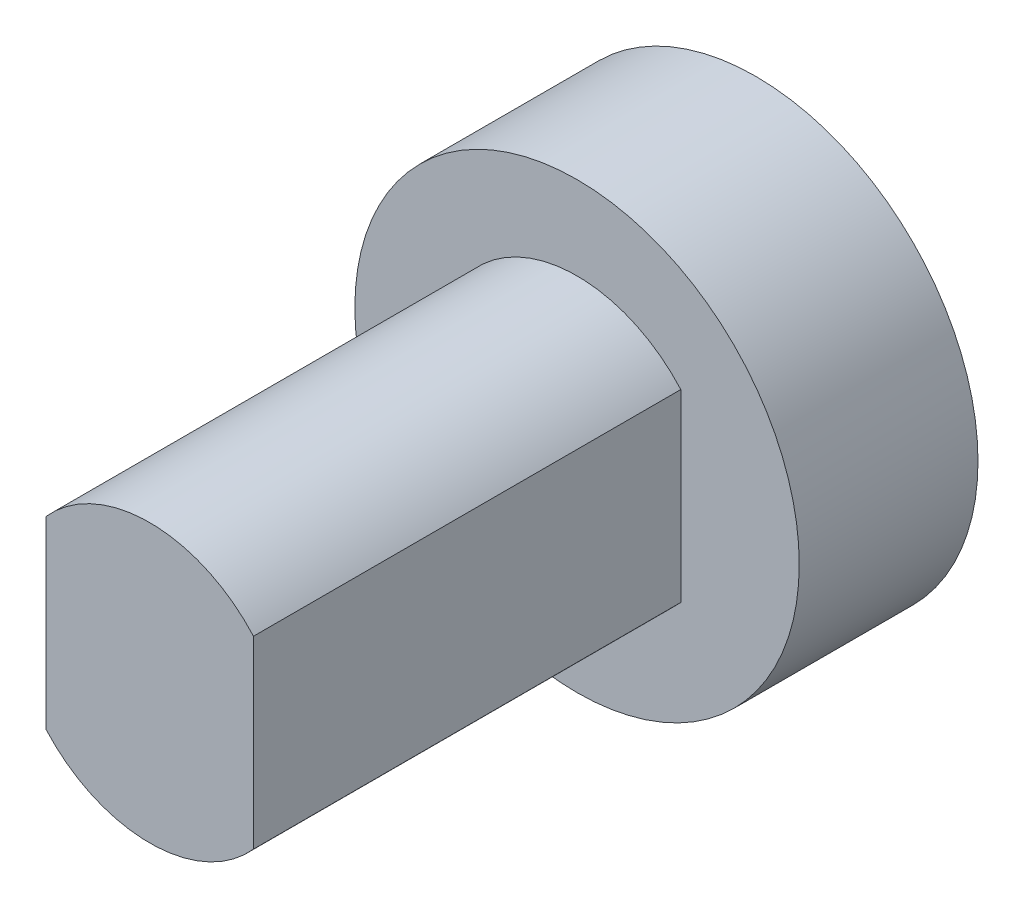
ISO-10303-21;
HEADER;
FILE_DESCRIPTION(('STEP AP214'),'2;1');
FILE_NAME('part.step','',(''),(''),'','','');
FILE_SCHEMA(('AUTOMOTIVE_DESIGN { 1 0 10303 214 1 1 1 1 }'));
ENDSEC;
DATA;
#1=APPLICATION_CONTEXT('core data for automotive mechanical design processes');
#2=APPLICATION_PROTOCOL_DEFINITION('international standard','automotive_design',2000,#1);
#3=PRODUCT_CONTEXT('',#1,'mechanical');
#4=PRODUCT('Part','Part','',(#3));
#5=PRODUCT_RELATED_PRODUCT_CATEGORY('part','',(#4));
#6=PRODUCT_DEFINITION_FORMATION('','',#4);
#7=PRODUCT_DEFINITION_CONTEXT('part definition',#1,'design');
#8=PRODUCT_DEFINITION('design','',#6,#7);
#9=PRODUCT_DEFINITION_SHAPE('','',#8);
#10=(LENGTH_UNIT() NAMED_UNIT(*) SI_UNIT(.MILLI.,.METRE.));
#11=(NAMED_UNIT(*) PLANE_ANGLE_UNIT() SI_UNIT($,.RADIAN.));
#12=(NAMED_UNIT(*) SI_UNIT($,.STERADIAN.) SOLID_ANGLE_UNIT());
#13=UNCERTAINTY_MEASURE_WITH_UNIT(LENGTH_MEASURE(1.E-05),#10,'distance_accuracy_value','');
#14=(GEOMETRIC_REPRESENTATION_CONTEXT(3) GLOBAL_UNCERTAINTY_ASSIGNED_CONTEXT((#13)) GLOBAL_UNIT_ASSIGNED_CONTEXT((#10,
#11,#12)) REPRESENTATION_CONTEXT('',''));
#15=CARTESIAN_POINT('',(0.,0.,0.));
#16=DIRECTION('',(0.,0.,1.));
#17=DIRECTION('',(1.,0.,0.));
#18=AXIS2_PLACEMENT_3D('',#15,#16,#17);
#19=CARTESIAN_POINT('',(0.,-11.0314213562373,0.));
#20=DIRECTION('',(0.,0.,1.));
#21=DIRECTION('',(1.,0.,0.));
#22=AXIS2_PLACEMENT_3D('',#19,#20,#21);
#23=PLANE('',#22);
#24=DIRECTION('',(0.,1.,0.));
#25=VECTOR('',#24,1.);
#26=CARTESIAN_POINT('',(-3.7,-11.0314213562373,0.));
#27=LINE('',#26,#25);
#28=CARTESIAN_POINT('',(-3.7,-3.28823660949147,0.));
#29=VERTEX_POINT('',#28);
#30=CARTESIAN_POINT('',(-3.7,3.28823660949147,0.));
#31=VERTEX_POINT('',#30);
#32=EDGE_CURVE('E57',#29,#31,#27,.T.);
#33=ORIENTED_EDGE('',*,*,#32,.F.);
#34=CARTESIAN_POINT('',(0.,0.,0.));
#35=DIRECTION('',(0.,0.,1.));
#36=DIRECTION('',(1.,0.,0.));
#37=AXIS2_PLACEMENT_3D('',#34,#35,#36);
#38=CIRCLE('',#37,4.95);
#39=CARTESIAN_POINT('',(3.7,-3.28823660949147,0.));
#40=VERTEX_POINT('',#39);
#41=EDGE_CURVE('E70',#40,#29,#38,.F.);
#42=ORIENTED_EDGE('',*,*,#41,.F.);
#43=DIRECTION('',(0.,1.,0.));
#44=VECTOR('',#43,1.);
#45=CARTESIAN_POINT('',(3.7,-11.0314213562373,0.));
#46=LINE('',#45,#44);
#47=CARTESIAN_POINT('',(3.7,3.28823660949147,0.));
#48=VERTEX_POINT('',#47);
#49=EDGE_CURVE('E60',#48,#40,#46,.F.);
#50=ORIENTED_EDGE('',*,*,#49,.F.);
#51=CARTESIAN_POINT('',(0.,0.,0.));
#52=DIRECTION('',(0.,0.,1.));
#53=DIRECTION('',(1.,0.,0.));
#54=AXIS2_PLACEMENT_3D('',#51,#52,#53);
#55=CIRCLE('',#54,4.95);
#56=EDGE_CURVE('E19',#31,#48,#55,.F.);
#57=ORIENTED_EDGE('',*,*,#56,.F.);
#58=EDGE_LOOP('',(#33,#42,#50,#57));
#59=FACE_BOUND('',#58,.T.);
#60=ADVANCED_FACE('F16',(#59),#23,.T.);
#61=CARTESIAN_POINT('',(0.,0.,-15.24));
#62=DIRECTION('',(0.,0.,1.));
#63=DIRECTION('',(1.,0.,0.));
#64=AXIS2_PLACEMENT_3D('',#61,#62,#63);
#65=CYLINDRICAL_SURFACE('',#64,4.95);
#66=CARTESIAN_POINT('',(0.,0.,-15.24));
#67=DIRECTION('',(0.,0.,1.));
#68=DIRECTION('',(1.,0.,0.));
#69=AXIS2_PLACEMENT_3D('',#66,#67,#68);
#70=CIRCLE('',#69,4.95);
#71=CARTESIAN_POINT('',(3.7,3.28823660949147,-15.24));
#72=VERTEX_POINT('',#71);
#73=CARTESIAN_POINT('',(-3.7,3.28823660949147,-15.24));
#74=VERTEX_POINT('',#73);
#75=EDGE_CURVE('E67',#72,#74,#70,.T.);
#76=ORIENTED_EDGE('',*,*,#75,.T.);
#77=DIRECTION('',(0.,0.,1.));
#78=VECTOR('',#77,1.);
#79=CARTESIAN_POINT('',(-3.7,3.28823660949148,-15.24));
#80=LINE('',#79,#78);
#81=EDGE_CURVE('E64',#31,#74,#80,.F.);
#82=ORIENTED_EDGE('',*,*,#81,.F.);
#83=ORIENTED_EDGE('',*,*,#56,.T.);
#84=DIRECTION('',(0.,0.,-1.));
#85=VECTOR('',#84,1.);
#86=CARTESIAN_POINT('',(3.7,3.28823660949147,-15.24));
#87=LINE('',#86,#85);
#88=EDGE_CURVE('E83',#72,#48,#87,.F.);
#89=ORIENTED_EDGE('',*,*,#88,.F.);
#90=EDGE_LOOP('',(#76,#82,#83,#89));
#91=FACE_BOUND('',#90,.T.);
#92=ADVANCED_FACE('F65',(#91),#65,.T.);
#93=CARTESIAN_POINT('',(-3.7,-11.0314213562373,-15.24));
#94=DIRECTION('',(-1.,0.,0.));
#95=DIRECTION('',(0.,0.,1.));
#96=AXIS2_PLACEMENT_3D('',#93,#94,#95);
#97=PLANE('',#96);
#98=DIRECTION('',(0.,1.,0.));
#99=VECTOR('',#98,1.);
#100=CARTESIAN_POINT('',(-3.7,0.,-15.24));
#101=LINE('',#100,#99);
#102=CARTESIAN_POINT('',(-3.7,-3.28823660949147,-15.24));
#103=VERTEX_POINT('',#102);
#104=EDGE_CURVE('E82',#74,#103,#101,.F.);
#105=ORIENTED_EDGE('',*,*,#104,.T.);
#106=DIRECTION('',(0.,0.,1.));
#107=VECTOR('',#106,1.);
#108=CARTESIAN_POINT('',(-3.7,-3.28823660949148,-15.24));
#109=LINE('',#108,#107);
#110=EDGE_CURVE('E73',#29,#103,#109,.F.);
#111=ORIENTED_EDGE('',*,*,#110,.F.);
#112=ORIENTED_EDGE('',*,*,#32,.T.);
#113=ORIENTED_EDGE('',*,*,#81,.T.);
#114=EDGE_LOOP('',(#105,#111,#112,#113));
#115=FACE_BOUND('',#114,.T.);
#116=ADVANCED_FACE('F72',(#115),#97,.T.);
#117=CARTESIAN_POINT('',(0.,0.,-15.24));
#118=DIRECTION('',(0.,0.,1.));
#119=DIRECTION('',(1.,0.,0.));
#120=AXIS2_PLACEMENT_3D('',#117,#118,#119);
#121=CYLINDRICAL_SURFACE('',#120,4.95);
#122=CARTESIAN_POINT('',(0.,0.,-15.24));
#123=DIRECTION('',(0.,0.,1.));
#124=DIRECTION('',(1.,0.,0.));
#125=AXIS2_PLACEMENT_3D('',#122,#123,#124);
#126=CIRCLE('',#125,4.95);
#127=CARTESIAN_POINT('',(3.7,-3.28823660949147,-15.24));
#128=VERTEX_POINT('',#127);
#129=EDGE_CURVE('E34',#103,#128,#126,.T.);
#130=ORIENTED_EDGE('',*,*,#129,.T.);
#131=DIRECTION('',(0.,0.,-1.));
#132=VECTOR('',#131,1.);
#133=CARTESIAN_POINT('',(3.7,-3.28823660949148,-15.24));
#134=LINE('',#133,#132);
#135=EDGE_CURVE('E85',#40,#128,#134,.T.);
#136=ORIENTED_EDGE('',*,*,#135,.F.);
#137=ORIENTED_EDGE('',*,*,#41,.T.);
#138=ORIENTED_EDGE('',*,*,#110,.T.);
#139=EDGE_LOOP('',(#130,#136,#137,#138));
#140=FACE_BOUND('',#139,.T.);
#141=ADVANCED_FACE('F108',(#140),#121,.T.);
#142=CARTESIAN_POINT('',(3.7,-11.0314213562373,-15.24));
#143=DIRECTION('',(1.,0.,0.));
#144=DIRECTION('',(0.,0.,-1.));
#145=AXIS2_PLACEMENT_3D('',#142,#143,#144);
#146=PLANE('',#145);
#147=DIRECTION('',(0.,1.,0.));
#148=VECTOR('',#147,1.);
#149=CARTESIAN_POINT('',(3.7,0.,-15.24));
#150=LINE('',#149,#148);
#151=EDGE_CURVE('E80',#128,#72,#150,.T.);
#152=ORIENTED_EDGE('',*,*,#151,.T.);
#153=ORIENTED_EDGE('',*,*,#88,.T.);
#154=ORIENTED_EDGE('',*,*,#49,.T.);
#155=ORIENTED_EDGE('',*,*,#135,.T.);
#156=EDGE_LOOP('',(#152,#153,#154,#155));
#157=FACE_BOUND('',#156,.T.);
#158=ADVANCED_FACE('F93',(#157),#146,.T.);
#159=CARTESIAN_POINT('',(0.,0.,-15.24));
#160=DIRECTION('',(0.,0.,-1.));
#161=DIRECTION('',(-1.,0.,0.));
#162=AXIS2_PLACEMENT_3D('',#159,#160,#161);
#163=PLANE('',#162);
#164=CARTESIAN_POINT('',(0.,0.,-15.24));
#165=DIRECTION('',(0.,0.,1.));
#166=DIRECTION('',(1.,0.,0.));
#167=AXIS2_PLACEMENT_3D('',#164,#165,#166);
#168=CIRCLE('',#167,7.9248);
#169=CARTESIAN_POINT('',(7.9248,0.,-15.24));
#170=VERTEX_POINT('',#169);
#171=EDGE_CURVE('E25',#170,#170,#168,.F.);
#172=ORIENTED_EDGE('',*,*,#171,.F.);
#173=EDGE_LOOP('',(#172));
#174=FACE_BOUND('',#173,.T.);
#175=ORIENTED_EDGE('',*,*,#129,.F.);
#176=ORIENTED_EDGE('',*,*,#104,.F.);
#177=ORIENTED_EDGE('',*,*,#75,.F.);
#178=ORIENTED_EDGE('',*,*,#151,.F.);
#179=EDGE_LOOP('',(#175,#176,#177,#178));
#180=FACE_BOUND('',#179,.T.);
#181=ADVANCED_FACE('F95',(#174,#180),#163,.F.);
#182=CARTESIAN_POINT('',(0.,0.,-21.6154));
#183=DIRECTION('',(0.,0.,1.));
#184=DIRECTION('',(1.,0.,0.));
#185=AXIS2_PLACEMENT_3D('',#182,#183,#184);
#186=CYLINDRICAL_SURFACE('',#185,7.9248);
#187=ORIENTED_EDGE('',*,*,#171,.T.);
#188=EDGE_LOOP('',(#187));
#189=FACE_BOUND('',#188,.T.);
#190=CARTESIAN_POINT('',(0.,0.,-21.6154));
#191=DIRECTION('',(0.,0.,1.));
#192=DIRECTION('',(1.,0.,0.));
#193=AXIS2_PLACEMENT_3D('',#190,#191,#192);
#194=CIRCLE('',#193,7.9248);
#195=CARTESIAN_POINT('',(7.9248,0.,-21.6154));
#196=VERTEX_POINT('',#195);
#197=EDGE_CURVE('E11',#196,#196,#194,.F.);
#198=ORIENTED_EDGE('',*,*,#197,.F.);
#199=EDGE_LOOP('',(#198));
#200=FACE_BOUND('',#199,.T.);
#201=ADVANCED_FACE('F97',(#189,#200),#186,.T.);
#202=CARTESIAN_POINT('',(0.,0.,-21.6154));
#203=DIRECTION('',(0.,0.,-1.));
#204=DIRECTION('',(-1.,0.,0.));
#205=AXIS2_PLACEMENT_3D('',#202,#203,#204);
#206=PLANE('',#205);
#207=ORIENTED_EDGE('',*,*,#197,.T.);
#208=EDGE_LOOP('',(#207));
#209=FACE_BOUND('',#208,.T.);
#210=ADVANCED_FACE('F105',(#209),#206,.T.);
#211=CLOSED_SHELL('',(#60,#92,#116,#141,#158,#181,#201,#210));
#212=MANIFOLD_SOLID_BREP('B1',#211);
#213=ADVANCED_BREP_SHAPE_REPRESENTATION('',(#18,#212),#14);
#214=SHAPE_DEFINITION_REPRESENTATION(#9,#213);
ENDSEC;
END-ISO-10303-21;
